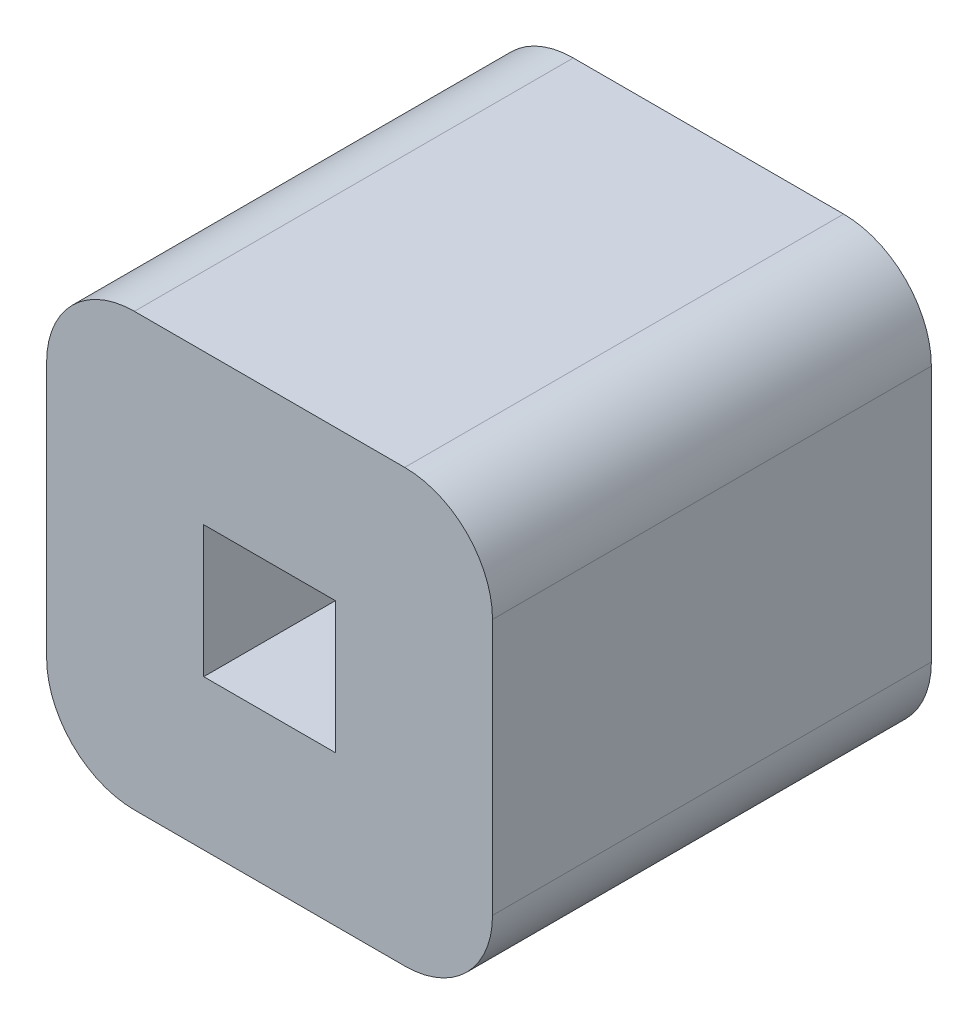
ISO-10303-21;
HEADER;
FILE_DESCRIPTION(('STEP AP214'),'2;1');
FILE_NAME('part.step','',(''),(''),'','','');
FILE_SCHEMA(('AUTOMOTIVE_DESIGN { 1 0 10303 214 1 1 1 1 }'));
ENDSEC;
DATA;
#1=APPLICATION_CONTEXT('core data for automotive mechanical design processes');
#2=APPLICATION_PROTOCOL_DEFINITION('international standard','automotive_design',2000,#1);
#3=PRODUCT_CONTEXT('',#1,'mechanical');
#4=PRODUCT('Part','Part','',(#3));
#5=PRODUCT_RELATED_PRODUCT_CATEGORY('part','',(#4));
#6=PRODUCT_DEFINITION_FORMATION('','',#4);
#7=PRODUCT_DEFINITION_CONTEXT('part definition',#1,'design');
#8=PRODUCT_DEFINITION('design','',#6,#7);
#9=PRODUCT_DEFINITION_SHAPE('','',#8);
#10=(LENGTH_UNIT() NAMED_UNIT(*) SI_UNIT(.MILLI.,.METRE.));
#11=(NAMED_UNIT(*) PLANE_ANGLE_UNIT() SI_UNIT($,.RADIAN.));
#12=(NAMED_UNIT(*) SI_UNIT($,.STERADIAN.) SOLID_ANGLE_UNIT());
#13=UNCERTAINTY_MEASURE_WITH_UNIT(LENGTH_MEASURE(1.E-05),#10,'distance_accuracy_value','');
#14=(GEOMETRIC_REPRESENTATION_CONTEXT(3) GLOBAL_UNCERTAINTY_ASSIGNED_CONTEXT((#13)) GLOBAL_UNIT_ASSIGNED_CONTEXT((#10,
#11,#12)) REPRESENTATION_CONTEXT('',''));
#15=CARTESIAN_POINT('',(0.,0.,0.));
#16=DIRECTION('',(0.,0.,1.));
#17=DIRECTION('',(1.,0.,0.));
#18=AXIS2_PLACEMENT_3D('',#15,#16,#17);
#19=CARTESIAN_POINT('',(0.670735714690617,-1.07588735959036,0.16337874015748));
#20=DIRECTION('',(0.,0.,-1.));
#21=DIRECTION('',(-1.,0.,0.));
#22=AXIS2_PLACEMENT_3D('',#19,#20,#21);
#23=PLANE('',#22);
#24=CARTESIAN_POINT('',(0.685420754060696,-0.946359800535238,0.16337874015748));
#25=DIRECTION('',(0.,0.,1.));
#26=DIRECTION('',(1.,0.,0.));
#27=AXIS2_PLACEMENT_3D('',#24,#25,#26);
#28=CIRCLE('',#27,0.0196850393700787);
#29=CARTESIAN_POINT('',(0.685420754060696,-0.966044839905316,0.16337874015748));
#30=VERTEX_POINT('',#29);
#31=CARTESIAN_POINT('',(0.665735714690617,-0.946359800535238,0.16337874015748));
#32=VERTEX_POINT('',#31);
#33=EDGE_CURVE('E159',#30,#32,#28,.F.);
#34=ORIENTED_EDGE('',*,*,#33,.F.);
#35=DIRECTION('',(1.,0.,0.));
#36=VECTOR('',#35,1.);
#37=CARTESIAN_POINT('',(0.749082171383531,-0.966044839905316,0.16337874015748));
#38=LINE('',#37,#36);
#39=CARTESIAN_POINT('',(0.746050675320538,-0.966044839905316,0.16337874015748));
#40=VERTEX_POINT('',#39);
#41=EDGE_CURVE('E134',#30,#40,#38,.T.);
#42=ORIENTED_EDGE('',*,*,#41,.T.);
#43=CARTESIAN_POINT('',(0.746050675320538,-0.946359800535238,0.16337874015748));
#44=DIRECTION('',(0.,0.,1.));
#45=DIRECTION('',(1.,0.,0.));
#46=AXIS2_PLACEMENT_3D('',#43,#44,#45);
#47=CIRCLE('',#46,0.0196850393700787);
#48=CARTESIAN_POINT('',(0.765735714690617,-0.946359800535238,0.16337874015748));
#49=VERTEX_POINT('',#48);
#50=EDGE_CURVE('E137',#49,#40,#47,.F.);
#51=ORIENTED_EDGE('',*,*,#50,.F.);
#52=DIRECTION('',(0.,1.,0.));
#53=VECTOR('',#52,1.);
#54=CARTESIAN_POINT('',(0.765735714690617,-0.781005469826576,0.16337874015748));
#55=LINE('',#54,#53);
#56=CARTESIAN_POINT('',(0.765735714690617,-0.888879485574608,0.16337874015748));
#57=VERTEX_POINT('',#56);
#58=EDGE_CURVE('E138',#49,#57,#55,.T.);
#59=ORIENTED_EDGE('',*,*,#58,.T.);
#60=CARTESIAN_POINT('',(0.746050675320538,-0.888879485574608,0.16337874015748));
#61=DIRECTION('',(0.,0.,-1.));
#62=DIRECTION('',(-1.,0.,0.));
#63=AXIS2_PLACEMENT_3D('',#60,#61,#62);
#64=CIRCLE('',#63,0.0196850393700787);
#65=CARTESIAN_POINT('',(0.746050675320538,-0.869194446204529,0.16337874015748));
#66=VERTEX_POINT('',#65);
#67=EDGE_CURVE('E164',#66,#57,#64,.T.);
#68=ORIENTED_EDGE('',*,*,#67,.F.);
#69=DIRECTION('',(1.,0.,0.));
#70=VECTOR('',#69,1.);
#71=CARTESIAN_POINT('',(0.749082171383531,-0.869194446204529,0.16337874015748));
#72=LINE('',#71,#70);
#73=CARTESIAN_POINT('',(0.685420754060696,-0.869194446204529,0.16337874015748));
#74=VERTEX_POINT('',#73);
#75=EDGE_CURVE('E143',#74,#66,#72,.T.);
#76=ORIENTED_EDGE('',*,*,#75,.F.);
#77=CARTESIAN_POINT('',(0.685420754060696,-0.888879485574608,0.16337874015748));
#78=DIRECTION('',(0.,0.,-1.));
#79=DIRECTION('',(-1.,0.,0.));
#80=AXIS2_PLACEMENT_3D('',#77,#78,#79);
#81=CIRCLE('',#80,0.0196850393700787);
#82=CARTESIAN_POINT('',(0.665735714690617,-0.888879485574608,0.16337874015748));
#83=VERTEX_POINT('',#82);
#84=EDGE_CURVE('E20',#83,#74,#81,.T.);
#85=ORIENTED_EDGE('',*,*,#84,.F.);
#86=DIRECTION('',(0.,1.,0.));
#87=VECTOR('',#86,1.);
#88=CARTESIAN_POINT('',(0.665735714690617,-0.917619643054923,0.16337874015748));
#89=LINE('',#88,#87);
#90=EDGE_CURVE('E84',#83,#32,#89,.F.);
#91=ORIENTED_EDGE('',*,*,#90,.T.);
#92=EDGE_LOOP('',(#34,#42,#51,#59,#68,#76,#85,#91));
#93=FACE_BOUND('',#92,.T.);
#94=DIRECTION('',(0.,1.,0.));
#95=VECTOR('',#94,1.);
#96=CARTESIAN_POINT('',(0.700971935163058,-0.901379485574608,0.16337874015748));
#97=LINE('',#96,#95);
#98=CARTESIAN_POINT('',(0.700971935163058,-0.932383422582482,0.16337874015748));
#99=VERTEX_POINT('',#98);
#100=CARTESIAN_POINT('',(0.700971935163058,-0.902855863527364,0.16337874015748));
#101=VERTEX_POINT('',#100);
#102=EDGE_CURVE('E94',#99,#101,#97,.T.);
#103=ORIENTED_EDGE('',*,*,#102,.T.);
#104=DIRECTION('',(1.,0.,0.));
#105=VECTOR('',#104,1.);
#106=CARTESIAN_POINT('',(0.699495557210302,-0.902855863527364,0.16337874015748));
#107=LINE('',#106,#105);
#108=CARTESIAN_POINT('',(0.730499494218176,-0.902855863527364,0.16337874015748));
#109=VERTEX_POINT('',#108);
#110=EDGE_CURVE('E110',#109,#101,#107,.F.);
#111=ORIENTED_EDGE('',*,*,#110,.F.);
#112=DIRECTION('',(0.,1.,0.));
#113=VECTOR('',#112,1.);
#114=CARTESIAN_POINT('',(0.730499494218176,-0.933859800535238,0.16337874015748));
#115=LINE('',#114,#113);
#116=CARTESIAN_POINT('',(0.730499494218176,-0.932383422582482,0.16337874015748));
#117=VERTEX_POINT('',#116);
#118=EDGE_CURVE('E106',#109,#117,#115,.F.);
#119=ORIENTED_EDGE('',*,*,#118,.T.);
#120=DIRECTION('',(1.,0.,0.));
#121=VECTOR('',#120,1.);
#122=CARTESIAN_POINT('',(0.699495557210302,-0.932383422582482,0.16337874015748));
#123=LINE('',#122,#121);
#124=EDGE_CURVE('E108',#117,#99,#123,.F.);
#125=ORIENTED_EDGE('',*,*,#124,.T.);
#126=EDGE_LOOP('',(#103,#111,#119,#125));
#127=FACE_BOUND('',#126,.T.);
#128=ADVANCED_FACE('F17',(#93,#127),#23,.F.);
#129=CARTESIAN_POINT('',(0.699495557210302,-0.932383422582482,0.152158267716535));
#130=DIRECTION('',(0.,-1.,0.));
#131=DIRECTION('',(0.,0.,-1.));
#132=AXIS2_PLACEMENT_3D('',#129,#130,#131);
#133=PLANE('',#132);
#134=DIRECTION('',(0.,0.,1.));
#135=VECTOR('',#134,1.);
#136=CARTESIAN_POINT('',(0.700971935163058,-0.932383422582482,0.152158267716535));
#137=LINE('',#136,#135);
#138=CARTESIAN_POINT('',(0.700971935163058,-0.932383422582482,0.0649535433070866));
#139=VERTEX_POINT('',#138);
#140=EDGE_CURVE('E120',#139,#99,#137,.T.);
#141=ORIENTED_EDGE('',*,*,#140,.T.);
#142=ORIENTED_EDGE('',*,*,#124,.F.);
#143=DIRECTION('',(0.,0.,-1.));
#144=VECTOR('',#143,1.);
#145=CARTESIAN_POINT('',(0.730499494218176,-0.932383422582482,0.152158267716535));
#146=LINE('',#145,#144);
#147=CARTESIAN_POINT('',(0.730499494218176,-0.932383422582482,0.0649535433070866));
#148=VERTEX_POINT('',#147);
#149=EDGE_CURVE('E112',#117,#148,#146,.T.);
#150=ORIENTED_EDGE('',*,*,#149,.T.);
#151=DIRECTION('',(-1.,0.,0.));
#152=VECTOR('',#151,1.);
#153=CARTESIAN_POINT('',(0.670735714690617,-0.932383422582482,0.0649535433070866));
#154=LINE('',#153,#152);
#155=EDGE_CURVE('E197',#139,#148,#154,.F.);
#156=ORIENTED_EDGE('',*,*,#155,.F.);
#157=EDGE_LOOP('',(#141,#142,#150,#156));
#158=FACE_BOUND('',#157,.T.);
#159=ADVANCED_FACE('F116',(#158),#133,.F.);
#160=CARTESIAN_POINT('',(0.730499494218176,-0.933859800535238,0.152158267716535));
#161=DIRECTION('',(1.,0.,0.));
#162=DIRECTION('',(0.,0.,-1.));
#163=AXIS2_PLACEMENT_3D('',#160,#161,#162);
#164=PLANE('',#163);
#165=ORIENTED_EDGE('',*,*,#149,.F.);
#166=ORIENTED_EDGE('',*,*,#118,.F.);
#167=DIRECTION('',(0.,0.,-1.));
#168=VECTOR('',#167,1.);
#169=CARTESIAN_POINT('',(0.730499494218176,-0.902855863527364,0.152158267716535));
#170=LINE('',#169,#168);
#171=CARTESIAN_POINT('',(0.730499494218176,-0.902855863527364,0.0649535433070866));
#172=VERTEX_POINT('',#171);
#173=EDGE_CURVE('E126',#172,#109,#170,.F.);
#174=ORIENTED_EDGE('',*,*,#173,.F.);
#175=DIRECTION('',(0.,1.,0.));
#176=VECTOR('',#175,1.);
#177=CARTESIAN_POINT('',(0.730499494218176,-1.07588735959036,0.0649535433070866));
#178=LINE('',#177,#176);
#179=EDGE_CURVE('E124',#148,#172,#178,.T.);
#180=ORIENTED_EDGE('',*,*,#179,.F.);
#181=EDGE_LOOP('',(#165,#166,#174,#180));
#182=FACE_BOUND('',#181,.T.);
#183=ADVANCED_FACE('F122',(#182),#164,.F.);
#184=CARTESIAN_POINT('',(0.699495557210302,-0.902855863527364,0.152158267716535));
#185=DIRECTION('',(0.,-1.,0.));
#186=DIRECTION('',(0.,0.,-1.));
#187=AXIS2_PLACEMENT_3D('',#184,#185,#186);
#188=PLANE('',#187);
#189=ORIENTED_EDGE('',*,*,#110,.T.);
#190=DIRECTION('',(0.,0.,1.));
#191=VECTOR('',#190,1.);
#192=CARTESIAN_POINT('',(0.700971935163058,-0.902855863527364,0.152158267716535));
#193=LINE('',#192,#191);
#194=CARTESIAN_POINT('',(0.700971935163058,-0.902855863527364,0.0649535433070866));
#195=VERTEX_POINT('',#194);
#196=EDGE_CURVE('E133',#101,#195,#193,.F.);
#197=ORIENTED_EDGE('',*,*,#196,.T.);
#198=DIRECTION('',(-1.,0.,0.));
#199=VECTOR('',#198,1.);
#200=CARTESIAN_POINT('',(0.670735714690617,-0.902855863527364,0.0649535433070866));
#201=LINE('',#200,#199);
#202=EDGE_CURVE('E193',#172,#195,#201,.T.);
#203=ORIENTED_EDGE('',*,*,#202,.F.);
#204=ORIENTED_EDGE('',*,*,#173,.T.);
#205=EDGE_LOOP('',(#189,#197,#203,#204));
#206=FACE_BOUND('',#205,.T.);
#207=ADVANCED_FACE('F182',(#206),#188,.T.);
#208=CARTESIAN_POINT('',(0.700971935163058,-0.901379485574608,0.152158267716535));
#209=DIRECTION('',(-1.,0.,0.));
#210=DIRECTION('',(0.,0.,1.));
#211=AXIS2_PLACEMENT_3D('',#208,#209,#210);
#212=PLANE('',#211);
#213=ORIENTED_EDGE('',*,*,#196,.F.);
#214=ORIENTED_EDGE('',*,*,#102,.F.);
#215=ORIENTED_EDGE('',*,*,#140,.F.);
#216=DIRECTION('',(0.,1.,0.));
#217=VECTOR('',#216,1.);
#218=CARTESIAN_POINT('',(0.700971935163058,-1.07588735959036,0.0649535433070866));
#219=LINE('',#218,#217);
#220=EDGE_CURVE('E188',#195,#139,#219,.F.);
#221=ORIENTED_EDGE('',*,*,#220,.F.);
#222=EDGE_LOOP('',(#213,#214,#215,#221));
#223=FACE_BOUND('',#222,.T.);
#224=ADVANCED_FACE('F186',(#223),#212,.F.);
#225=CARTESIAN_POINT('',(0.665735714690617,-0.917619643054923,0.114166141732283));
#226=DIRECTION('',(1.,0.,0.));
#227=DIRECTION('',(0.,1.,0.));
#228=AXIS2_PLACEMENT_3D('',#225,#226,#227);
#229=PLANE('',#228);
#230=DIRECTION('',(0.,0.,1.));
#231=VECTOR('',#230,1.);
#232=CARTESIAN_POINT('',(0.665735714690617,-0.946359800535238,0.1683));
#233=LINE('',#232,#231);
#234=CARTESIAN_POINT('',(0.665735714690617,-0.946359800535238,0.0649535433070866));
#235=VERTEX_POINT('',#234);
#236=EDGE_CURVE('E162',#32,#235,#233,.F.);
#237=ORIENTED_EDGE('',*,*,#236,.F.);
#238=ORIENTED_EDGE('',*,*,#90,.F.);
#239=DIRECTION('',(0.,0.,-1.));
#240=VECTOR('',#239,1.);
#241=CARTESIAN_POINT('',(0.665735714690617,-0.888879485574608,0.1683));
#242=LINE('',#241,#240);
#243=CARTESIAN_POINT('',(0.665735714690617,-0.888879485574608,0.0649535433070866));
#244=VERTEX_POINT('',#243);
#245=EDGE_CURVE('E132',#244,#83,#242,.F.);
#246=ORIENTED_EDGE('',*,*,#245,.F.);
#247=DIRECTION('',(0.,1.,0.));
#248=VECTOR('',#247,1.);
#249=CARTESIAN_POINT('',(0.665735714690617,-1.07588735959036,0.0649535433070866));
#250=LINE('',#249,#248);
#251=EDGE_CURVE('E158',#235,#244,#250,.T.);
#252=ORIENTED_EDGE('',*,*,#251,.F.);
#253=EDGE_LOOP('',(#237,#238,#246,#252));
#254=FACE_BOUND('',#253,.T.);
#255=ADVANCED_FACE('F227',(#254),#229,.F.);
#256=CARTESIAN_POINT('',(0.685420754060696,-0.888879485574608,0.1683));
#257=DIRECTION('',(0.,0.,-1.));
#258=DIRECTION('',(-1.,0.,0.));
#259=AXIS2_PLACEMENT_3D('',#256,#257,#258);
#260=CYLINDRICAL_SURFACE('',#259,0.0196850393700787);
#261=ORIENTED_EDGE('',*,*,#84,.T.);
#262=DIRECTION('',(0.,0.,1.));
#263=VECTOR('',#262,1.);
#264=CARTESIAN_POINT('',(0.685420754060696,-0.869194446204529,0.0600322834645669));
#265=LINE('',#264,#263);
#266=CARTESIAN_POINT('',(0.685420754060696,-0.869194446204529,0.0649535433070866));
#267=VERTEX_POINT('',#266);
#268=EDGE_CURVE('E145',#267,#74,#265,.T.);
#269=ORIENTED_EDGE('',*,*,#268,.F.);
#270=CARTESIAN_POINT('',(0.685420754060696,-0.888879485574608,0.0649535433070866));
#271=DIRECTION('',(0.,0.,-1.));
#272=DIRECTION('',(-1.,0.,0.));
#273=AXIS2_PLACEMENT_3D('',#270,#271,#272);
#274=CIRCLE('',#273,0.0196850393700787);
#275=EDGE_CURVE('E155',#244,#267,#274,.T.);
#276=ORIENTED_EDGE('',*,*,#275,.F.);
#277=ORIENTED_EDGE('',*,*,#245,.T.);
#278=EDGE_LOOP('',(#261,#269,#276,#277));
#279=FACE_BOUND('',#278,.T.);
#280=ADVANCED_FACE('F250',(#279),#260,.T.);
#281=CARTESIAN_POINT('',(0.749082171383531,-0.869194446204529,0.0600322834645669));
#282=DIRECTION('',(0.,1.,0.));
#283=DIRECTION('',(0.,0.,1.));
#284=AXIS2_PLACEMENT_3D('',#281,#282,#283);
#285=PLANE('',#284);
#286=ORIENTED_EDGE('',*,*,#75,.T.);
#287=DIRECTION('',(0.,0.,-1.));
#288=VECTOR('',#287,1.);
#289=CARTESIAN_POINT('',(0.746050675320538,-0.869194446204529,0.1683));
#290=LINE('',#289,#288);
#291=CARTESIAN_POINT('',(0.746050675320538,-0.869194446204529,0.0649535433070866));
#292=VERTEX_POINT('',#291);
#293=EDGE_CURVE('E144',#292,#66,#290,.F.);
#294=ORIENTED_EDGE('',*,*,#293,.F.);
#295=DIRECTION('',(-1.,0.,0.));
#296=VECTOR('',#295,1.);
#297=CARTESIAN_POINT('',(0.670735714690617,-0.869194446204529,0.0649535433070866));
#298=LINE('',#297,#296);
#299=EDGE_CURVE('E154',#267,#292,#298,.F.);
#300=ORIENTED_EDGE('',*,*,#299,.F.);
#301=ORIENTED_EDGE('',*,*,#268,.T.);
#302=EDGE_LOOP('',(#286,#294,#300,#301));
#303=FACE_BOUND('',#302,.T.);
#304=ADVANCED_FACE('F247',(#303),#285,.T.);
#305=CARTESIAN_POINT('',(0.746050675320538,-0.888879485574608,0.1683));
#306=DIRECTION('',(0.,0.,-1.));
#307=DIRECTION('',(-1.,0.,0.));
#308=AXIS2_PLACEMENT_3D('',#305,#306,#307);
#309=CYLINDRICAL_SURFACE('',#308,0.0196850393700787);
#310=ORIENTED_EDGE('',*,*,#67,.T.);
#311=DIRECTION('',(0.,0.,1.));
#312=VECTOR('',#311,1.);
#313=CARTESIAN_POINT('',(0.765735714690617,-0.888879485574608,0.0600322834645669));
#314=LINE('',#313,#312);
#315=CARTESIAN_POINT('',(0.765735714690617,-0.888879485574608,0.0649535433070866));
#316=VERTEX_POINT('',#315);
#317=EDGE_CURVE('E142',#57,#316,#314,.F.);
#318=ORIENTED_EDGE('',*,*,#317,.T.);
#319=CARTESIAN_POINT('',(0.746050675320538,-0.888879485574608,0.0649535433070866));
#320=DIRECTION('',(0.,0.,-1.));
#321=DIRECTION('',(-1.,0.,0.));
#322=AXIS2_PLACEMENT_3D('',#319,#320,#321);
#323=CIRCLE('',#322,0.0196850393700787);
#324=EDGE_CURVE('E151',#292,#316,#323,.T.);
#325=ORIENTED_EDGE('',*,*,#324,.F.);
#326=ORIENTED_EDGE('',*,*,#293,.T.);
#327=EDGE_LOOP('',(#310,#318,#325,#326));
#328=FACE_BOUND('',#327,.T.);
#329=ADVANCED_FACE('F244',(#328),#309,.T.);
#330=CARTESIAN_POINT('',(0.765735714690617,-0.781005469826576,0.0600322834645669));
#331=DIRECTION('',(-1.,0.,0.));
#332=DIRECTION('',(0.,0.,1.));
#333=AXIS2_PLACEMENT_3D('',#330,#331,#332);
#334=PLANE('',#333);
#335=DIRECTION('',(0.,0.,1.));
#336=VECTOR('',#335,1.);
#337=CARTESIAN_POINT('',(0.765735714690617,-0.946359800535238,0.1683));
#338=LINE('',#337,#336);
#339=CARTESIAN_POINT('',(0.765735714690617,-0.946359800535238,0.0649535433070866));
#340=VERTEX_POINT('',#339);
#341=EDGE_CURVE('E141',#340,#49,#338,.T.);
#342=ORIENTED_EDGE('',*,*,#341,.F.);
#343=DIRECTION('',(0.,1.,0.));
#344=VECTOR('',#343,1.);
#345=CARTESIAN_POINT('',(0.765735714690617,-1.07588735959036,0.0649535433070866));
#346=LINE('',#345,#344);
#347=EDGE_CURVE('E150',#316,#340,#346,.F.);
#348=ORIENTED_EDGE('',*,*,#347,.F.);
#349=ORIENTED_EDGE('',*,*,#317,.F.);
#350=ORIENTED_EDGE('',*,*,#58,.F.);
#351=EDGE_LOOP('',(#342,#348,#349,#350));
#352=FACE_BOUND('',#351,.T.);
#353=ADVANCED_FACE('F214',(#352),#334,.F.);
#354=CARTESIAN_POINT('',(0.746050675320538,-0.946359800535238,0.1683));
#355=DIRECTION('',(0.,0.,1.));
#356=DIRECTION('',(1.,0.,0.));
#357=AXIS2_PLACEMENT_3D('',#354,#355,#356);
#358=CYLINDRICAL_SURFACE('',#357,0.0196850393700787);
#359=ORIENTED_EDGE('',*,*,#50,.T.);
#360=DIRECTION('',(0.,0.,1.));
#361=VECTOR('',#360,1.);
#362=CARTESIAN_POINT('',(0.746050675320538,-0.966044839905316,0.0600322834645669));
#363=LINE('',#362,#361);
#364=CARTESIAN_POINT('',(0.746050675320538,-0.966044839905316,0.0649535433070866));
#365=VERTEX_POINT('',#364);
#366=EDGE_CURVE('E136',#40,#365,#363,.F.);
#367=ORIENTED_EDGE('',*,*,#366,.T.);
#368=CARTESIAN_POINT('',(0.746050675320538,-0.946359800535238,0.0649535433070866));
#369=DIRECTION('',(0.,0.,1.));
#370=DIRECTION('',(1.,0.,0.));
#371=AXIS2_PLACEMENT_3D('',#368,#369,#370);
#372=CIRCLE('',#371,0.0196850393700787);
#373=EDGE_CURVE('E147',#340,#365,#372,.F.);
#374=ORIENTED_EDGE('',*,*,#373,.F.);
#375=ORIENTED_EDGE('',*,*,#341,.T.);
#376=EDGE_LOOP('',(#359,#367,#374,#375));
#377=FACE_BOUND('',#376,.T.);
#378=ADVANCED_FACE('F208',(#377),#358,.T.);
#379=CARTESIAN_POINT('',(0.749082171383531,-0.966044839905316,0.0600322834645669));
#380=DIRECTION('',(0.,1.,0.));
#381=DIRECTION('',(0.,0.,1.));
#382=AXIS2_PLACEMENT_3D('',#379,#380,#381);
#383=PLANE('',#382);
#384=ORIENTED_EDGE('',*,*,#366,.F.);
#385=ORIENTED_EDGE('',*,*,#41,.F.);
#386=DIRECTION('',(0.,0.,1.));
#387=VECTOR('',#386,1.);
#388=CARTESIAN_POINT('',(0.685420754060696,-0.966044839905317,0.1683));
#389=LINE('',#388,#387);
#390=CARTESIAN_POINT('',(0.685420754060696,-0.966044839905316,0.0649535433070866));
#391=VERTEX_POINT('',#390);
#392=EDGE_CURVE('E35',#391,#30,#389,.T.);
#393=ORIENTED_EDGE('',*,*,#392,.F.);
#394=DIRECTION('',(-1.,0.,0.));
#395=VECTOR('',#394,1.);
#396=CARTESIAN_POINT('',(0.670735714690617,-0.966044839905316,0.0649535433070866));
#397=LINE('',#396,#395);
#398=EDGE_CURVE('E26',#365,#391,#397,.T.);
#399=ORIENTED_EDGE('',*,*,#398,.F.);
#400=EDGE_LOOP('',(#384,#385,#393,#399));
#401=FACE_BOUND('',#400,.T.);
#402=ADVANCED_FACE('F218',(#401),#383,.F.);
#403=CARTESIAN_POINT('',(0.685420754060696,-0.946359800535238,0.1683));
#404=DIRECTION('',(0.,0.,1.));
#405=DIRECTION('',(1.,0.,0.));
#406=AXIS2_PLACEMENT_3D('',#403,#404,#405);
#407=CYLINDRICAL_SURFACE('',#406,0.0196850393700787);
#408=ORIENTED_EDGE('',*,*,#33,.T.);
#409=ORIENTED_EDGE('',*,*,#236,.T.);
#410=CARTESIAN_POINT('',(0.685420754060696,-0.946359800535238,0.0649535433070866));
#411=DIRECTION('',(0.,0.,1.));
#412=DIRECTION('',(1.,0.,0.));
#413=AXIS2_PLACEMENT_3D('',#410,#411,#412);
#414=CIRCLE('',#413,0.0196850393700787);
#415=EDGE_CURVE('E11',#391,#235,#414,.F.);
#416=ORIENTED_EDGE('',*,*,#415,.F.);
#417=ORIENTED_EDGE('',*,*,#392,.T.);
#418=EDGE_LOOP('',(#408,#409,#416,#417));
#419=FACE_BOUND('',#418,.T.);
#420=ADVANCED_FACE('F229',(#419),#407,.T.);
#421=CARTESIAN_POINT('',(0.670735714690617,-1.07588735959036,0.0649535433070866));
#422=DIRECTION('',(0.,0.,-1.));
#423=DIRECTION('',(-1.,0.,0.));
#424=AXIS2_PLACEMENT_3D('',#421,#422,#423);
#425=PLANE('',#424);
#426=ORIENTED_EDGE('',*,*,#398,.T.);
#427=ORIENTED_EDGE('',*,*,#415,.T.);
#428=ORIENTED_EDGE('',*,*,#251,.T.);
#429=ORIENTED_EDGE('',*,*,#275,.T.);
#430=ORIENTED_EDGE('',*,*,#299,.T.);
#431=ORIENTED_EDGE('',*,*,#324,.T.);
#432=ORIENTED_EDGE('',*,*,#347,.T.);
#433=ORIENTED_EDGE('',*,*,#373,.T.);
#434=EDGE_LOOP('',(#426,#427,#428,#429,#430,#431,#432,#433));
#435=FACE_BOUND('',#434,.T.);
#436=ORIENTED_EDGE('',*,*,#202,.T.);
#437=ORIENTED_EDGE('',*,*,#220,.T.);
#438=ORIENTED_EDGE('',*,*,#155,.T.);
#439=ORIENTED_EDGE('',*,*,#179,.T.);
#440=EDGE_LOOP('',(#436,#437,#438,#439));
#441=FACE_BOUND('',#440,.T.);
#442=ADVANCED_FACE('F195',(#435,#441),#425,.T.);
#443=CLOSED_SHELL('',(#128,#159,#183,#207,#224,#255,#280,#304,#329,#353,#378,#402,#420,#442));
#444=MANIFOLD_SOLID_BREP('B1',#443);
#445=ADVANCED_BREP_SHAPE_REPRESENTATION('',(#18,#444),#14);
#446=SHAPE_DEFINITION_REPRESENTATION(#9,#445);
ENDSEC;
END-ISO-10303-21;
